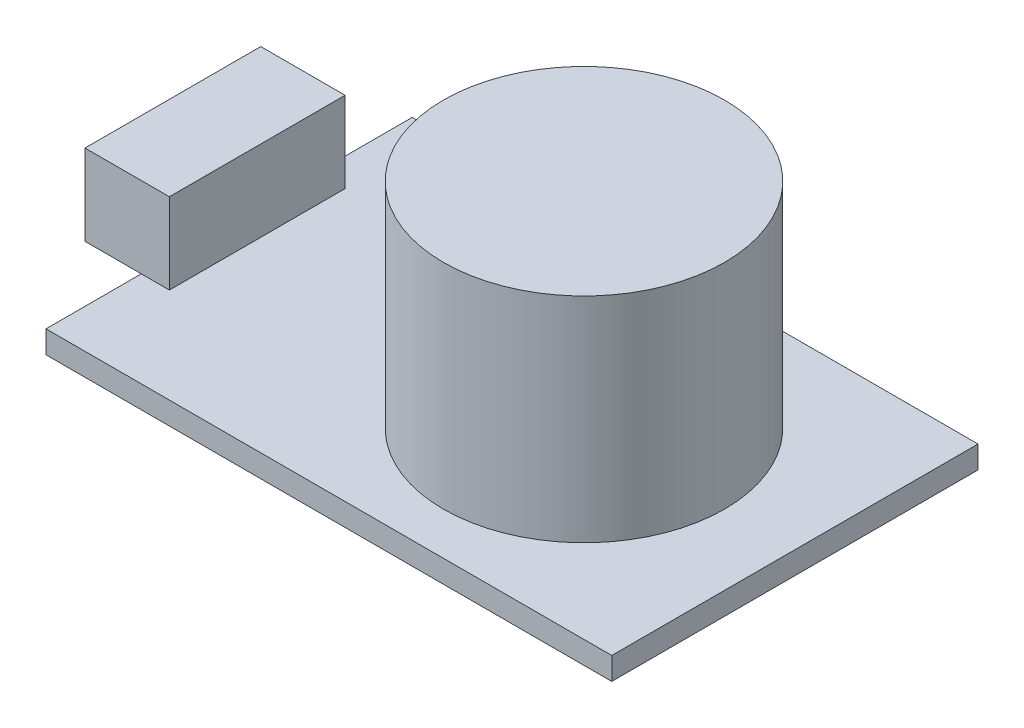
ISO-10303-21;
HEADER;
FILE_DESCRIPTION(('STEP AP214'),'2;1');
FILE_NAME('part.step','',(''),(''),'','','');
FILE_SCHEMA(('AUTOMOTIVE_DESIGN { 1 0 10303 214 1 1 1 1 }'));
ENDSEC;
DATA;
#1=APPLICATION_CONTEXT('core data for automotive mechanical design processes');
#2=APPLICATION_PROTOCOL_DEFINITION('international standard','automotive_design',2000,#1);
#3=PRODUCT_CONTEXT('',#1,'mechanical');
#4=PRODUCT('Part','Part','',(#3));
#5=PRODUCT_RELATED_PRODUCT_CATEGORY('part','',(#4));
#6=PRODUCT_DEFINITION_FORMATION('','',#4);
#7=PRODUCT_DEFINITION_CONTEXT('part definition',#1,'design');
#8=PRODUCT_DEFINITION('design','',#6,#7);
#9=PRODUCT_DEFINITION_SHAPE('','',#8);
#10=(LENGTH_UNIT() NAMED_UNIT(*) SI_UNIT(.MILLI.,.METRE.));
#11=(NAMED_UNIT(*) PLANE_ANGLE_UNIT() SI_UNIT($,.RADIAN.));
#12=(NAMED_UNIT(*) SI_UNIT($,.STERADIAN.) SOLID_ANGLE_UNIT());
#13=UNCERTAINTY_MEASURE_WITH_UNIT(LENGTH_MEASURE(1.E-05),#10,'distance_accuracy_value','');
#14=(GEOMETRIC_REPRESENTATION_CONTEXT(3) GLOBAL_UNCERTAINTY_ASSIGNED_CONTEXT((#13)) GLOBAL_UNIT_ASSIGNED_CONTEXT((#10,
#11,#12)) REPRESENTATION_CONTEXT('',''));
#15=CARTESIAN_POINT('',(0.,0.,0.));
#16=DIRECTION('',(0.,0.,1.));
#17=DIRECTION('',(1.,0.,0.));
#18=AXIS2_PLACEMENT_3D('',#15,#16,#17);
#19=CARTESIAN_POINT('',(0.,1.6,0.));
#20=DIRECTION('',(0.,1.,0.));
#21=DIRECTION('',(0.,0.,1.));
#22=AXIS2_PLACEMENT_3D('',#19,#20,#21);
#23=PLANE('',#22);
#24=CARTESIAN_POINT('',(25.24,1.6,-13.025));
#25=DIRECTION('',(0.,1.,0.));
#26=DIRECTION('',(0.,0.,1.));
#27=AXIS2_PLACEMENT_3D('',#24,#25,#26);
#28=CIRCLE('',#27,10.);
#29=CARTESIAN_POINT('',(25.24,1.6,-3.025));
#30=VERTEX_POINT('',#29);
#31=EDGE_CURVE('E11',#30,#30,#28,.T.);
#32=ORIENTED_EDGE('',*,*,#31,.F.);
#33=EDGE_LOOP('',(#32));
#34=FACE_BOUND('',#33,.T.);
#35=DIRECTION('',(0.,0.,-1.));
#36=VECTOR('',#35,1.);
#37=CARTESIAN_POINT('',(2.,1.6,0.));
#38=LINE('',#37,#36);
#39=CARTESIAN_POINT('',(2.,1.6,-6.775));
#40=VERTEX_POINT('',#39);
#41=CARTESIAN_POINT('',(2.,1.6,-19.275));
#42=VERTEX_POINT('',#41);
#43=EDGE_CURVE('E128',#40,#42,#38,.T.);
#44=ORIENTED_EDGE('',*,*,#43,.F.);
#45=DIRECTION('',(-1.,0.,0.));
#46=VECTOR('',#45,1.);
#47=CARTESIAN_POINT('',(2.,1.6,-6.775));
#48=LINE('',#47,#46);
#49=CARTESIAN_POINT('',(0.,1.6,-6.775));
#50=VERTEX_POINT('',#49);
#51=EDGE_CURVE('E52',#40,#50,#48,.T.);
#52=ORIENTED_EDGE('',*,*,#51,.T.);
#53=DIRECTION('',(0.,0.,1.));
#54=VECTOR('',#53,1.);
#55=CARTESIAN_POINT('',(0.,1.6,-26.05));
#56=LINE('',#55,#54);
#57=CARTESIAN_POINT('',(0.,1.6,0.));
#58=VERTEX_POINT('',#57);
#59=EDGE_CURVE('E88',#50,#58,#56,.T.);
#60=ORIENTED_EDGE('',*,*,#59,.T.);
#61=DIRECTION('',(1.,0.,0.));
#62=VECTOR('',#61,1.);
#63=CARTESIAN_POINT('',(0.,1.6,0.));
#64=LINE('',#63,#62);
#65=CARTESIAN_POINT('',(40.24,1.6,0.));
#66=VERTEX_POINT('',#65);
#67=EDGE_CURVE('E165',#58,#66,#64,.T.);
#68=ORIENTED_EDGE('',*,*,#67,.T.);
#69=DIRECTION('',(0.,0.,-1.));
#70=VECTOR('',#69,1.);
#71=CARTESIAN_POINT('',(40.24,1.6,0.));
#72=LINE('',#71,#70);
#73=CARTESIAN_POINT('',(40.24,1.6,-26.05));
#74=VERTEX_POINT('',#73);
#75=EDGE_CURVE('E168',#66,#74,#72,.T.);
#76=ORIENTED_EDGE('',*,*,#75,.T.);
#77=DIRECTION('',(-1.,0.,0.));
#78=VECTOR('',#77,1.);
#79=CARTESIAN_POINT('',(40.24,1.6,-26.05));
#80=LINE('',#79,#78);
#81=CARTESIAN_POINT('',(0.,1.6,-26.05));
#82=VERTEX_POINT('',#81);
#83=EDGE_CURVE('E61',#74,#82,#80,.T.);
#84=ORIENTED_EDGE('',*,*,#83,.T.);
#85=CARTESIAN_POINT('',(0.,1.6,-19.275));
#86=VERTEX_POINT('',#85);
#87=EDGE_CURVE('E163',#82,#86,#56,.T.);
#88=ORIENTED_EDGE('',*,*,#87,.T.);
#89=DIRECTION('',(-1.,0.,0.));
#90=VECTOR('',#89,1.);
#91=CARTESIAN_POINT('',(2.,1.6,-19.275));
#92=LINE('',#91,#90);
#93=EDGE_CURVE('E155',#42,#86,#92,.T.);
#94=ORIENTED_EDGE('',*,*,#93,.F.);
#95=EDGE_LOOP('',(#44,#52,#60,#68,#76,#84,#88,#94));
#96=FACE_BOUND('',#95,.T.);
#97=ADVANCED_FACE('F36',(#34,#96),#23,.T.);
#98=CARTESIAN_POINT('',(0.,1.6,-26.05));
#99=DIRECTION('',(1.,0.,0.));
#100=DIRECTION('',(0.,0.,-1.));
#101=AXIS2_PLACEMENT_3D('',#98,#99,#100);
#102=PLANE('',#101);
#103=DIRECTION('',(0.,0.,1.));
#104=VECTOR('',#103,1.);
#105=CARTESIAN_POINT('',(0.,0.,-26.05));
#106=LINE('',#105,#104);
#107=CARTESIAN_POINT('',(0.,0.,-26.05));
#108=VERTEX_POINT('',#107);
#109=CARTESIAN_POINT('',(0.,0.,0.));
#110=VERTEX_POINT('',#109);
#111=EDGE_CURVE('E161',#108,#110,#106,.T.);
#112=ORIENTED_EDGE('',*,*,#111,.T.);
#113=DIRECTION('',(0.,-1.,0.));
#114=VECTOR('',#113,1.);
#115=CARTESIAN_POINT('',(0.,1.6,0.));
#116=LINE('',#115,#114);
#117=EDGE_CURVE('E40',#58,#110,#116,.T.);
#118=ORIENTED_EDGE('',*,*,#117,.F.);
#119=ORIENTED_EDGE('',*,*,#59,.F.);
#120=EDGE_CURVE('E166',#86,#50,#56,.T.);
#121=ORIENTED_EDGE('',*,*,#120,.F.);
#122=ORIENTED_EDGE('',*,*,#87,.F.);
#123=DIRECTION('',(0.,-1.,0.));
#124=VECTOR('',#123,1.);
#125=CARTESIAN_POINT('',(0.,1.6,-26.05));
#126=LINE('',#125,#124);
#127=EDGE_CURVE('E171',#82,#108,#126,.T.);
#128=ORIENTED_EDGE('',*,*,#127,.T.);
#129=EDGE_LOOP('',(#112,#118,#119,#121,#122,#128));
#130=FACE_BOUND('',#129,.T.);
#131=ADVANCED_FACE('F38',(#130),#102,.F.);
#132=CARTESIAN_POINT('',(0.,1.6,0.));
#133=DIRECTION('',(0.,0.,-1.));
#134=DIRECTION('',(-1.,0.,0.));
#135=AXIS2_PLACEMENT_3D('',#132,#133,#134);
#136=PLANE('',#135);
#137=DIRECTION('',(1.,0.,0.));
#138=VECTOR('',#137,1.);
#139=CARTESIAN_POINT('',(0.,0.,0.));
#140=LINE('',#139,#138);
#141=CARTESIAN_POINT('',(40.24,0.,0.));
#142=VERTEX_POINT('',#141);
#143=EDGE_CURVE('E174',#110,#142,#140,.T.);
#144=ORIENTED_EDGE('',*,*,#143,.T.);
#145=DIRECTION('',(0.,-1.,0.));
#146=VECTOR('',#145,1.);
#147=CARTESIAN_POINT('',(40.24,1.6,0.));
#148=LINE('',#147,#146);
#149=EDGE_CURVE('E181',#66,#142,#148,.T.);
#150=ORIENTED_EDGE('',*,*,#149,.F.);
#151=ORIENTED_EDGE('',*,*,#67,.F.);
#152=ORIENTED_EDGE('',*,*,#117,.T.);
#153=EDGE_LOOP('',(#144,#150,#151,#152));
#154=FACE_BOUND('',#153,.T.);
#155=ADVANCED_FACE('F190',(#154),#136,.F.);
#156=CARTESIAN_POINT('',(40.24,1.6,0.));
#157=DIRECTION('',(-1.,0.,0.));
#158=DIRECTION('',(0.,0.,1.));
#159=AXIS2_PLACEMENT_3D('',#156,#157,#158);
#160=PLANE('',#159);
#161=DIRECTION('',(0.,0.,-1.));
#162=VECTOR('',#161,1.);
#163=CARTESIAN_POINT('',(40.24,0.,0.));
#164=LINE('',#163,#162);
#165=CARTESIAN_POINT('',(40.24,0.,-26.05));
#166=VERTEX_POINT('',#165);
#167=EDGE_CURVE('E176',#142,#166,#164,.T.);
#168=ORIENTED_EDGE('',*,*,#167,.T.);
#169=DIRECTION('',(0.,-1.,0.));
#170=VECTOR('',#169,1.);
#171=CARTESIAN_POINT('',(40.24,1.6,-26.05));
#172=LINE('',#171,#170);
#173=EDGE_CURVE('E180',#74,#166,#172,.T.);
#174=ORIENTED_EDGE('',*,*,#173,.F.);
#175=ORIENTED_EDGE('',*,*,#75,.F.);
#176=ORIENTED_EDGE('',*,*,#149,.T.);
#177=EDGE_LOOP('',(#168,#174,#175,#176));
#178=FACE_BOUND('',#177,.T.);
#179=ADVANCED_FACE('F197',(#178),#160,.F.);
#180=CARTESIAN_POINT('',(40.24,1.6,-26.05));
#181=DIRECTION('',(0.,0.,1.));
#182=DIRECTION('',(1.,0.,0.));
#183=AXIS2_PLACEMENT_3D('',#180,#181,#182);
#184=PLANE('',#183);
#185=DIRECTION('',(-1.,0.,0.));
#186=VECTOR('',#185,1.);
#187=CARTESIAN_POINT('',(40.24,0.,-26.05));
#188=LINE('',#187,#186);
#189=EDGE_CURVE('E82',#166,#108,#188,.T.);
#190=ORIENTED_EDGE('',*,*,#189,.T.);
#191=ORIENTED_EDGE('',*,*,#127,.F.);
#192=ORIENTED_EDGE('',*,*,#83,.F.);
#193=ORIENTED_EDGE('',*,*,#173,.T.);
#194=EDGE_LOOP('',(#190,#191,#192,#193));
#195=FACE_BOUND('',#194,.T.);
#196=ADVANCED_FACE('F198',(#195),#184,.F.);
#197=CARTESIAN_POINT('',(0.,0.,0.));
#198=DIRECTION('',(0.,1.,0.));
#199=DIRECTION('',(0.,0.,1.));
#200=AXIS2_PLACEMENT_3D('',#197,#198,#199);
#201=PLANE('',#200);
#202=ORIENTED_EDGE('',*,*,#111,.F.);
#203=ORIENTED_EDGE('',*,*,#189,.F.);
#204=ORIENTED_EDGE('',*,*,#167,.F.);
#205=ORIENTED_EDGE('',*,*,#143,.F.);
#206=EDGE_LOOP('',(#202,#203,#204,#205));
#207=FACE_BOUND('',#206,.T.);
#208=ADVANCED_FACE('F195',(#207),#201,.F.);
#209=CARTESIAN_POINT('',(25.24,16.8,-13.025));
#210=DIRECTION('',(0.,-1.,0.));
#211=DIRECTION('',(0.,0.,-1.));
#212=AXIS2_PLACEMENT_3D('',#209,#210,#211);
#213=CYLINDRICAL_SURFACE('',#212,10.);
#214=CARTESIAN_POINT('',(25.24,16.8,-13.025));
#215=DIRECTION('',(0.,1.,0.));
#216=DIRECTION('',(0.,0.,1.));
#217=AXIS2_PLACEMENT_3D('',#214,#215,#216);
#218=CIRCLE('',#217,10.);
#219=CARTESIAN_POINT('',(25.24,16.8,-3.025));
#220=VERTEX_POINT('',#219);
#221=EDGE_CURVE('E153',#220,#220,#218,.T.);
#222=ORIENTED_EDGE('',*,*,#221,.F.);
#223=EDGE_LOOP('',(#222));
#224=FACE_BOUND('',#223,.T.);
#225=ORIENTED_EDGE('',*,*,#31,.T.);
#226=EDGE_LOOP('',(#225));
#227=FACE_BOUND('',#226,.T.);
#228=ADVANCED_FACE('F225',(#224,#227),#213,.T.);
#229=CARTESIAN_POINT('',(0.,16.8,0.));
#230=DIRECTION('',(0.,1.,0.));
#231=DIRECTION('',(0.,0.,1.));
#232=AXIS2_PLACEMENT_3D('',#229,#230,#231);
#233=PLANE('',#232);
#234=ORIENTED_EDGE('',*,*,#221,.T.);
#235=EDGE_LOOP('',(#234));
#236=FACE_BOUND('',#235,.T.);
#237=ADVANCED_FACE('F255',(#236),#233,.T.);
#238=CARTESIAN_POINT('',(2.,1.6,0.));
#239=DIRECTION('',(0.,1.,0.));
#240=DIRECTION('',(0.,0.,1.));
#241=AXIS2_PLACEMENT_3D('',#238,#239,#240);
#242=PLANE('',#241);
#243=CARTESIAN_POINT('',(-4.,1.6,-19.275));
#244=VERTEX_POINT('',#243);
#245=EDGE_CURVE('E158',#86,#244,#92,.T.);
#246=ORIENTED_EDGE('',*,*,#245,.F.);
#247=ORIENTED_EDGE('',*,*,#120,.T.);
#248=CARTESIAN_POINT('',(-4.,1.6,-6.775));
#249=VERTEX_POINT('',#248);
#250=EDGE_CURVE('E154',#50,#249,#48,.T.);
#251=ORIENTED_EDGE('',*,*,#250,.T.);
#252=DIRECTION('',(0.,0.,-1.));
#253=VECTOR('',#252,1.);
#254=CARTESIAN_POINT('',(-4.,1.6,0.));
#255=LINE('',#254,#253);
#256=EDGE_CURVE('E137',#249,#244,#255,.T.);
#257=ORIENTED_EDGE('',*,*,#256,.T.);
#258=EDGE_LOOP('',(#246,#247,#251,#257));
#259=FACE_BOUND('',#258,.T.);
#260=ADVANCED_FACE('F262',(#259),#242,.F.);
#261=CARTESIAN_POINT('',(2.,0.,-6.775));
#262=DIRECTION('',(0.,0.,-1.));
#263=DIRECTION('',(-1.,0.,0.));
#264=AXIS2_PLACEMENT_3D('',#261,#262,#263);
#265=PLANE('',#264);
#266=DIRECTION('',(-1.,0.,0.));
#267=VECTOR('',#266,1.);
#268=CARTESIAN_POINT('',(2.,7.35,-6.775));
#269=LINE('',#268,#267);
#270=CARTESIAN_POINT('',(2.,7.35,-6.775));
#271=VERTEX_POINT('',#270);
#272=CARTESIAN_POINT('',(-4.,7.35,-6.775));
#273=VERTEX_POINT('',#272);
#274=EDGE_CURVE('E118',#271,#273,#269,.T.);
#275=ORIENTED_EDGE('',*,*,#274,.T.);
#276=DIRECTION('',(0.,-1.,0.));
#277=VECTOR('',#276,1.);
#278=CARTESIAN_POINT('',(-4.,0.,-6.775));
#279=LINE('',#278,#277);
#280=EDGE_CURVE('E121',#273,#249,#279,.T.);
#281=ORIENTED_EDGE('',*,*,#280,.T.);
#282=ORIENTED_EDGE('',*,*,#250,.F.);
#283=ORIENTED_EDGE('',*,*,#51,.F.);
#284=DIRECTION('',(0.,-1.,0.));
#285=VECTOR('',#284,1.);
#286=CARTESIAN_POINT('',(2.,0.,-6.775));
#287=LINE('',#286,#285);
#288=EDGE_CURVE('E123',#271,#40,#287,.T.);
#289=ORIENTED_EDGE('',*,*,#288,.F.);
#290=EDGE_LOOP('',(#275,#281,#282,#283,#289));
#291=FACE_BOUND('',#290,.T.);
#292=ADVANCED_FACE('F120',(#291),#265,.F.);
#293=CARTESIAN_POINT('',(2.,0.,-19.275));
#294=DIRECTION('',(0.,0.,1.));
#295=DIRECTION('',(1.,0.,0.));
#296=AXIS2_PLACEMENT_3D('',#293,#294,#295);
#297=PLANE('',#296);
#298=ORIENTED_EDGE('',*,*,#93,.T.);
#299=ORIENTED_EDGE('',*,*,#245,.T.);
#300=DIRECTION('',(0.,1.,0.));
#301=VECTOR('',#300,1.);
#302=CARTESIAN_POINT('',(-4.,0.,-19.275));
#303=LINE('',#302,#301);
#304=CARTESIAN_POINT('',(-4.,7.35,-19.275));
#305=VERTEX_POINT('',#304);
#306=EDGE_CURVE('E141',#244,#305,#303,.T.);
#307=ORIENTED_EDGE('',*,*,#306,.T.);
#308=DIRECTION('',(-1.,0.,0.));
#309=VECTOR('',#308,1.);
#310=CARTESIAN_POINT('',(2.,7.35,-19.275));
#311=LINE('',#310,#309);
#312=CARTESIAN_POINT('',(2.,7.35,-19.275));
#313=VERTEX_POINT('',#312);
#314=EDGE_CURVE('E127',#313,#305,#311,.T.);
#315=ORIENTED_EDGE('',*,*,#314,.F.);
#316=DIRECTION('',(0.,1.,0.));
#317=VECTOR('',#316,1.);
#318=CARTESIAN_POINT('',(2.,0.,-19.275));
#319=LINE('',#318,#317);
#320=EDGE_CURVE('E149',#42,#313,#319,.T.);
#321=ORIENTED_EDGE('',*,*,#320,.F.);
#322=EDGE_LOOP('',(#298,#299,#307,#315,#321));
#323=FACE_BOUND('',#322,.T.);
#324=ADVANCED_FACE('F204',(#323),#297,.F.);
#325=CARTESIAN_POINT('',(2.,7.35,0.));
#326=DIRECTION('',(0.,-1.,0.));
#327=DIRECTION('',(0.,0.,-1.));
#328=AXIS2_PLACEMENT_3D('',#325,#326,#327);
#329=PLANE('',#328);
#330=ORIENTED_EDGE('',*,*,#314,.T.);
#331=DIRECTION('',(0.,0.,1.));
#332=VECTOR('',#331,1.);
#333=CARTESIAN_POINT('',(-4.,7.35,0.));
#334=LINE('',#333,#332);
#335=EDGE_CURVE('E134',#305,#273,#334,.T.);
#336=ORIENTED_EDGE('',*,*,#335,.T.);
#337=ORIENTED_EDGE('',*,*,#274,.F.);
#338=DIRECTION('',(0.,0.,1.));
#339=VECTOR('',#338,1.);
#340=CARTESIAN_POINT('',(2.,7.35,0.));
#341=LINE('',#340,#339);
#342=EDGE_CURVE('E147',#313,#271,#341,.T.);
#343=ORIENTED_EDGE('',*,*,#342,.F.);
#344=EDGE_LOOP('',(#330,#336,#337,#343));
#345=FACE_BOUND('',#344,.T.);
#346=ADVANCED_FACE('F139',(#345),#329,.F.);
#347=CARTESIAN_POINT('',(2.,0.,0.));
#348=DIRECTION('',(-1.,0.,0.));
#349=DIRECTION('',(0.,0.,1.));
#350=AXIS2_PLACEMENT_3D('',#347,#348,#349);
#351=PLANE('',#350);
#352=ORIENTED_EDGE('',*,*,#288,.T.);
#353=ORIENTED_EDGE('',*,*,#43,.T.);
#354=ORIENTED_EDGE('',*,*,#320,.T.);
#355=ORIENTED_EDGE('',*,*,#342,.T.);
#356=EDGE_LOOP('',(#352,#353,#354,#355));
#357=FACE_BOUND('',#356,.T.);
#358=ADVANCED_FACE('F206',(#357),#351,.F.);
#359=CARTESIAN_POINT('',(-4.,0.,0.));
#360=DIRECTION('',(-1.,0.,0.));
#361=DIRECTION('',(0.,0.,1.));
#362=AXIS2_PLACEMENT_3D('',#359,#360,#361);
#363=PLANE('',#362);
#364=ORIENTED_EDGE('',*,*,#280,.F.);
#365=ORIENTED_EDGE('',*,*,#335,.F.);
#366=ORIENTED_EDGE('',*,*,#306,.F.);
#367=ORIENTED_EDGE('',*,*,#256,.F.);
#368=EDGE_LOOP('',(#364,#365,#366,#367));
#369=FACE_BOUND('',#368,.T.);
#370=ADVANCED_FACE('F132',(#369),#363,.T.);
#371=CLOSED_SHELL('',(#97,#131,#155,#179,#196,#208,#228,#237,#260,#292,#324,#346,#358,#370));
#372=MANIFOLD_SOLID_BREP('B2',#371);
#373=ADVANCED_BREP_SHAPE_REPRESENTATION('',(#18,#372),#14);
#374=SHAPE_DEFINITION_REPRESENTATION(#9,#373);
ENDSEC;
END-ISO-10303-21;
